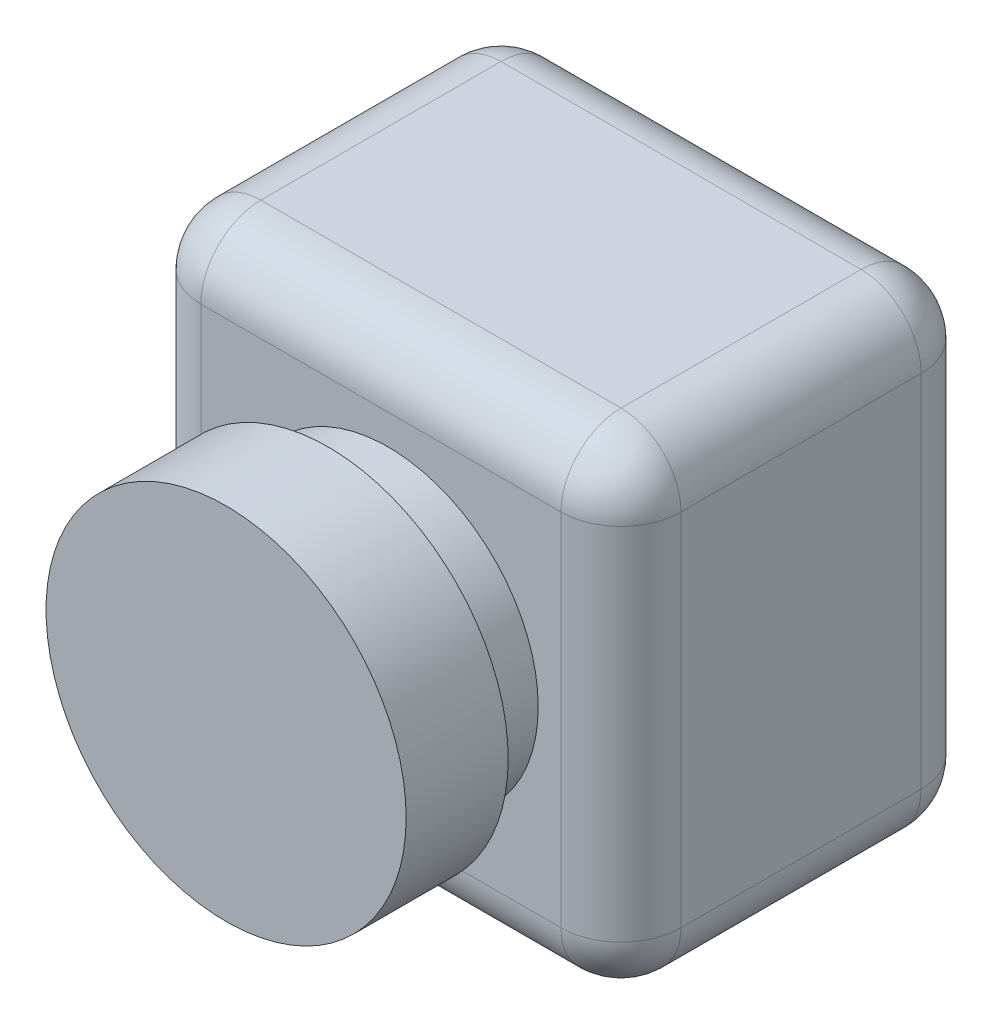
ISO-10303-21;
HEADER;
FILE_DESCRIPTION(('STEP AP214'),'2;1');
FILE_NAME('part.step','',(''),(''),'','','');
FILE_SCHEMA(('AUTOMOTIVE_DESIGN { 1 0 10303 214 1 1 1 1 }'));
ENDSEC;
DATA;
#1=APPLICATION_CONTEXT('core data for automotive mechanical design processes');
#2=APPLICATION_PROTOCOL_DEFINITION('international standard','automotive_design',2000,#1);
#3=PRODUCT_CONTEXT('',#1,'mechanical');
#4=PRODUCT('Part','Part','',(#3));
#5=PRODUCT_RELATED_PRODUCT_CATEGORY('part','',(#4));
#6=PRODUCT_DEFINITION_FORMATION('','',#4);
#7=PRODUCT_DEFINITION_CONTEXT('part definition',#1,'design');
#8=PRODUCT_DEFINITION('design','',#6,#7);
#9=PRODUCT_DEFINITION_SHAPE('','',#8);
#10=(LENGTH_UNIT() NAMED_UNIT(*) SI_UNIT(.MILLI.,.METRE.));
#11=(NAMED_UNIT(*) PLANE_ANGLE_UNIT() SI_UNIT($,.RADIAN.));
#12=(NAMED_UNIT(*) SI_UNIT($,.STERADIAN.) SOLID_ANGLE_UNIT());
#13=UNCERTAINTY_MEASURE_WITH_UNIT(LENGTH_MEASURE(1.E-05),#10,'distance_accuracy_value','');
#14=(GEOMETRIC_REPRESENTATION_CONTEXT(3) GLOBAL_UNCERTAINTY_ASSIGNED_CONTEXT((#13)) GLOBAL_UNIT_ASSIGNED_CONTEXT((#10,
#11,#12)) REPRESENTATION_CONTEXT('',''));
#15=CARTESIAN_POINT('',(0.,0.,0.));
#16=DIRECTION('',(0.,0.,1.));
#17=DIRECTION('',(1.,0.,0.));
#18=AXIS2_PLACEMENT_3D('',#15,#16,#17);
#19=CARTESIAN_POINT('',(0.,0.,60.));
#20=DIRECTION('',(1.,0.,0.));
#21=DIRECTION('',(0.,1.,0.));
#22=AXIS2_PLACEMENT_3D('',#19,#20,#21);
#23=PLANE('',#22);
#24=DIRECTION('',(0.,0.,-1.));
#25=VECTOR('',#24,1.);
#26=CARTESIAN_POINT('',(0.,-70.,60.));
#27=LINE('',#26,#25);
#28=CARTESIAN_POINT('',(0.,-70.,10.));
#29=VERTEX_POINT('',#28);
#30=CARTESIAN_POINT('',(0.,-70.,50.));
#31=VERTEX_POINT('',#30);
#32=EDGE_CURVE('E181',#29,#31,#27,.F.);
#33=ORIENTED_EDGE('',*,*,#32,.T.);
#34=DIRECTION('',(0.,-1.,0.));
#35=VECTOR('',#34,1.);
#36=CARTESIAN_POINT('',(0.,0.,50.));
#37=LINE('',#36,#35);
#38=CARTESIAN_POINT('',(0.,-10.,50.));
#39=VERTEX_POINT('',#38);
#40=EDGE_CURVE('E183',#31,#39,#37,.F.);
#41=ORIENTED_EDGE('',*,*,#40,.T.);
#42=DIRECTION('',(0.,0.,-1.));
#43=VECTOR('',#42,1.);
#44=CARTESIAN_POINT('',(0.,-10.,60.));
#45=LINE('',#44,#43);
#46=CARTESIAN_POINT('',(0.,-10.,10.));
#47=VERTEX_POINT('',#46);
#48=EDGE_CURVE('E177',#39,#47,#45,.T.);
#49=ORIENTED_EDGE('',*,*,#48,.T.);
#50=DIRECTION('',(0.,-1.,0.));
#51=VECTOR('',#50,1.);
#52=CARTESIAN_POINT('',(0.,0.,10.));
#53=LINE('',#52,#51);
#54=EDGE_CURVE('E179',#47,#29,#53,.T.);
#55=ORIENTED_EDGE('',*,*,#54,.T.);
#56=EDGE_LOOP('',(#33,#41,#49,#55));
#57=FACE_BOUND('',#56,.T.);
#58=ADVANCED_FACE('F33',(#57),#23,.F.);
#59=CARTESIAN_POINT('',(0.,-80.,60.));
#60=DIRECTION('',(0.,1.,0.));
#61=DIRECTION('',(0.,0.,1.));
#62=AXIS2_PLACEMENT_3D('',#59,#60,#61);
#63=PLANE('',#62);
#64=DIRECTION('',(1.,0.,0.));
#65=VECTOR('',#64,1.);
#66=CARTESIAN_POINT('',(0.,-80.,50.));
#67=LINE('',#66,#65);
#68=CARTESIAN_POINT('',(70.,-80.,50.));
#69=VERTEX_POINT('',#68);
#70=CARTESIAN_POINT('',(10.,-80.,50.));
#71=VERTEX_POINT('',#70);
#72=EDGE_CURVE('E129',#69,#71,#67,.F.);
#73=ORIENTED_EDGE('',*,*,#72,.T.);
#74=DIRECTION('',(0.,0.,-1.));
#75=VECTOR('',#74,1.);
#76=CARTESIAN_POINT('',(10.,-80.,60.));
#77=LINE('',#76,#75);
#78=CARTESIAN_POINT('',(10.,-80.,10.));
#79=VERTEX_POINT('',#78);
#80=EDGE_CURVE('E166',#71,#79,#77,.T.);
#81=ORIENTED_EDGE('',*,*,#80,.T.);
#82=DIRECTION('',(1.,0.,0.));
#83=VECTOR('',#82,1.);
#84=CARTESIAN_POINT('',(0.,-80.,10.));
#85=LINE('',#84,#83);
#86=CARTESIAN_POINT('',(70.,-80.,10.));
#87=VERTEX_POINT('',#86);
#88=EDGE_CURVE('E159',#79,#87,#85,.T.);
#89=ORIENTED_EDGE('',*,*,#88,.T.);
#90=DIRECTION('',(0.,0.,-1.));
#91=VECTOR('',#90,1.);
#92=CARTESIAN_POINT('',(70.,-80.,60.));
#93=LINE('',#92,#91);
#94=EDGE_CURVE('E157',#87,#69,#93,.F.);
#95=ORIENTED_EDGE('',*,*,#94,.T.);
#96=EDGE_LOOP('',(#73,#81,#89,#95));
#97=FACE_BOUND('',#96,.T.);
#98=ADVANCED_FACE('F327',(#97),#63,.F.);
#99=CARTESIAN_POINT('',(80.,0.,60.));
#100=DIRECTION('',(-1.,0.,0.));
#101=DIRECTION('',(0.,-1.,0.));
#102=AXIS2_PLACEMENT_3D('',#99,#100,#101);
#103=PLANE('',#102);
#104=DIRECTION('',(0.,1.,0.));
#105=VECTOR('',#104,1.);
#106=CARTESIAN_POINT('',(80.,-80.,50.));
#107=LINE('',#106,#105);
#108=CARTESIAN_POINT('',(80.,-10.,50.));
#109=VERTEX_POINT('',#108);
#110=CARTESIAN_POINT('',(80.,-70.,50.));
#111=VERTEX_POINT('',#110);
#112=EDGE_CURVE('E42',#109,#111,#107,.F.);
#113=ORIENTED_EDGE('',*,*,#112,.T.);
#114=DIRECTION('',(0.,0.,-1.));
#115=VECTOR('',#114,1.);
#116=CARTESIAN_POINT('',(80.,-70.,60.));
#117=LINE('',#116,#115);
#118=CARTESIAN_POINT('',(80.,-70.,10.));
#119=VERTEX_POINT('',#118);
#120=EDGE_CURVE('E11',#111,#119,#117,.T.);
#121=ORIENTED_EDGE('',*,*,#120,.T.);
#122=DIRECTION('',(0.,1.,0.));
#123=VECTOR('',#122,1.);
#124=CARTESIAN_POINT('',(80.,0.,10.));
#125=LINE('',#124,#123);
#126=CARTESIAN_POINT('',(80.,-10.,10.));
#127=VERTEX_POINT('',#126);
#128=EDGE_CURVE('E195',#119,#127,#125,.T.);
#129=ORIENTED_EDGE('',*,*,#128,.T.);
#130=DIRECTION('',(0.,0.,-1.));
#131=VECTOR('',#130,1.);
#132=CARTESIAN_POINT('',(80.,-10.,60.));
#133=LINE('',#132,#131);
#134=EDGE_CURVE('E53',#127,#109,#133,.F.);
#135=ORIENTED_EDGE('',*,*,#134,.T.);
#136=EDGE_LOOP('',(#113,#121,#129,#135));
#137=FACE_BOUND('',#136,.T.);
#138=ADVANCED_FACE('F332',(#137),#103,.F.);
#139=CARTESIAN_POINT('',(0.,0.,60.));
#140=DIRECTION('',(0.,-1.,0.));
#141=DIRECTION('',(0.,0.,-1.));
#142=AXIS2_PLACEMENT_3D('',#139,#140,#141);
#143=PLANE('',#142);
#144=DIRECTION('',(0.,0.,-1.));
#145=VECTOR('',#144,1.);
#146=CARTESIAN_POINT('',(10.,0.,60.));
#147=LINE('',#146,#145);
#148=CARTESIAN_POINT('',(10.,0.,10.));
#149=VERTEX_POINT('',#148);
#150=CARTESIAN_POINT('',(10.,0.,50.));
#151=VERTEX_POINT('',#150);
#152=EDGE_CURVE('E190',#149,#151,#147,.F.);
#153=ORIENTED_EDGE('',*,*,#152,.T.);
#154=DIRECTION('',(-1.,0.,0.));
#155=VECTOR('',#154,1.);
#156=CARTESIAN_POINT('',(80.,0.,50.));
#157=LINE('',#156,#155);
#158=CARTESIAN_POINT('',(70.,0.,50.));
#159=VERTEX_POINT('',#158);
#160=EDGE_CURVE('E192',#151,#159,#157,.F.);
#161=ORIENTED_EDGE('',*,*,#160,.T.);
#162=DIRECTION('',(0.,0.,-1.));
#163=VECTOR('',#162,1.);
#164=CARTESIAN_POINT('',(70.,0.,60.));
#165=LINE('',#164,#163);
#166=CARTESIAN_POINT('',(70.,0.,10.));
#167=VERTEX_POINT('',#166);
#168=EDGE_CURVE('E186',#159,#167,#165,.T.);
#169=ORIENTED_EDGE('',*,*,#168,.T.);
#170=DIRECTION('',(-1.,0.,0.));
#171=VECTOR('',#170,1.);
#172=CARTESIAN_POINT('',(0.,0.,10.));
#173=LINE('',#172,#171);
#174=EDGE_CURVE('E188',#167,#149,#173,.T.);
#175=ORIENTED_EDGE('',*,*,#174,.T.);
#176=EDGE_LOOP('',(#153,#161,#169,#175));
#177=FACE_BOUND('',#176,.T.);
#178=ADVANCED_FACE('F278',(#177),#143,.F.);
#179=CARTESIAN_POINT('',(0.,0.,60.));
#180=DIRECTION('',(0.,0.,1.));
#181=DIRECTION('',(1.,0.,0.));
#182=AXIS2_PLACEMENT_3D('',#179,#180,#181);
#183=PLANE('',#182);
#184=CARTESIAN_POINT('',(41.2074397884217,-40.,60.));
#185=DIRECTION('',(0.,0.,1.));
#186=DIRECTION('',(1.,0.,0.));
#187=AXIS2_PLACEMENT_3D('',#184,#185,#186);
#188=CIRCLE('',#187,25.);
#189=CARTESIAN_POINT('',(66.2074397884217,-40.,60.));
#190=VERTEX_POINT('',#189);
#191=EDGE_CURVE('E389',#190,#190,#188,.T.);
#192=ORIENTED_EDGE('',*,*,#191,.F.);
#193=EDGE_LOOP('',(#192));
#194=FACE_BOUND('',#193,.T.);
#195=DIRECTION('',(0.,-1.,0.));
#196=VECTOR('',#195,1.);
#197=CARTESIAN_POINT('',(10.,-80.,60.));
#198=LINE('',#197,#196);
#199=CARTESIAN_POINT('',(10.,-10.,60.));
#200=VERTEX_POINT('',#199);
#201=CARTESIAN_POINT('',(10.,-70.,60.));
#202=VERTEX_POINT('',#201);
#203=EDGE_CURVE('E155',#200,#202,#198,.T.);
#204=ORIENTED_EDGE('',*,*,#203,.T.);
#205=DIRECTION('',(1.,0.,0.));
#206=VECTOR('',#205,1.);
#207=CARTESIAN_POINT('',(80.,-70.,60.));
#208=LINE('',#207,#206);
#209=CARTESIAN_POINT('',(70.,-70.,60.));
#210=VERTEX_POINT('',#209);
#211=EDGE_CURVE('E127',#202,#210,#208,.T.);
#212=ORIENTED_EDGE('',*,*,#211,.T.);
#213=DIRECTION('',(0.,1.,0.));
#214=VECTOR('',#213,1.);
#215=CARTESIAN_POINT('',(70.,0.,60.));
#216=LINE('',#215,#214);
#217=CARTESIAN_POINT('',(70.,-10.,60.));
#218=VERTEX_POINT('',#217);
#219=EDGE_CURVE('E145',#210,#218,#216,.T.);
#220=ORIENTED_EDGE('',*,*,#219,.T.);
#221=DIRECTION('',(-1.,0.,0.));
#222=VECTOR('',#221,1.);
#223=CARTESIAN_POINT('',(0.,-10.,60.));
#224=LINE('',#223,#222);
#225=EDGE_CURVE('E151',#218,#200,#224,.T.);
#226=ORIENTED_EDGE('',*,*,#225,.T.);
#227=EDGE_LOOP('',(#204,#212,#220,#226));
#228=FACE_BOUND('',#227,.T.);
#229=ADVANCED_FACE('F153',(#194,#228),#183,.T.);
#230=CARTESIAN_POINT('',(0.,0.,0.));
#231=DIRECTION('',(0.,0.,1.));
#232=DIRECTION('',(1.,0.,0.));
#233=AXIS2_PLACEMENT_3D('',#230,#231,#232);
#234=PLANE('',#233);
#235=DIRECTION('',(0.,1.,0.));
#236=VECTOR('',#235,1.);
#237=CARTESIAN_POINT('',(70.,0.,0.));
#238=LINE('',#237,#236);
#239=CARTESIAN_POINT('',(70.,-10.,0.));
#240=VERTEX_POINT('',#239);
#241=CARTESIAN_POINT('',(70.,-70.,0.));
#242=VERTEX_POINT('',#241);
#243=EDGE_CURVE('E168',#240,#242,#238,.F.);
#244=ORIENTED_EDGE('',*,*,#243,.T.);
#245=DIRECTION('',(1.,0.,0.));
#246=VECTOR('',#245,1.);
#247=CARTESIAN_POINT('',(0.,-70.,0.));
#248=LINE('',#247,#246);
#249=CARTESIAN_POINT('',(10.,-70.,0.));
#250=VERTEX_POINT('',#249);
#251=EDGE_CURVE('E174',#242,#250,#248,.F.);
#252=ORIENTED_EDGE('',*,*,#251,.T.);
#253=DIRECTION('',(0.,-1.,0.));
#254=VECTOR('',#253,1.);
#255=CARTESIAN_POINT('',(10.,0.,0.));
#256=LINE('',#255,#254);
#257=CARTESIAN_POINT('',(10.,-10.,0.));
#258=VERTEX_POINT('',#257);
#259=EDGE_CURVE('E172',#250,#258,#256,.F.);
#260=ORIENTED_EDGE('',*,*,#259,.T.);
#261=DIRECTION('',(-1.,0.,0.));
#262=VECTOR('',#261,1.);
#263=CARTESIAN_POINT('',(0.,-10.,0.));
#264=LINE('',#263,#262);
#265=EDGE_CURVE('E170',#258,#240,#264,.F.);
#266=ORIENTED_EDGE('',*,*,#265,.T.);
#267=EDGE_LOOP('',(#244,#252,#260,#266));
#268=FACE_BOUND('',#267,.T.);
#269=ADVANCED_FACE('F296',(#268),#234,.F.);
#270=CARTESIAN_POINT('',(0.,-10.,10.));
#271=DIRECTION('',(-1.,0.,0.));
#272=DIRECTION('',(0.,0.,1.));
#273=AXIS2_PLACEMENT_3D('',#270,#271,#272);
#274=CYLINDRICAL_SURFACE('',#273,10.);
#275=CARTESIAN_POINT('',(10.,-10.,10.));
#276=DIRECTION('',(-1.,0.,0.));
#277=DIRECTION('',(0.,0.,1.));
#278=AXIS2_PLACEMENT_3D('',#275,#276,#277);
#279=CIRCLE('',#278,10.);
#280=EDGE_CURVE('E37',#149,#258,#279,.T.);
#281=ORIENTED_EDGE('',*,*,#280,.F.);
#282=ORIENTED_EDGE('',*,*,#174,.F.);
#283=CARTESIAN_POINT('',(70.,-10.,10.));
#284=DIRECTION('',(1.,0.,0.));
#285=DIRECTION('',(0.,0.,-1.));
#286=AXIS2_PLACEMENT_3D('',#283,#284,#285);
#287=CIRCLE('',#286,10.);
#288=EDGE_CURVE('E247',#240,#167,#287,.T.);
#289=ORIENTED_EDGE('',*,*,#288,.F.);
#290=ORIENTED_EDGE('',*,*,#265,.F.);
#291=EDGE_LOOP('',(#281,#282,#289,#290));
#292=FACE_BOUND('',#291,.T.);
#293=ADVANCED_FACE('F35',(#292),#274,.T.);
#294=CARTESIAN_POINT('',(10.,-10.,10.));
#295=DIRECTION('',(0.,0.,1.));
#296=DIRECTION('',(1.,0.,0.));
#297=AXIS2_PLACEMENT_3D('',#294,#295,#296);
#298=SPHERICAL_SURFACE('',#297,10.);
#299=CARTESIAN_POINT('',(10.,-10.,10.));
#300=DIRECTION('',(0.,0.,-1.));
#301=DIRECTION('',(-1.,0.,0.));
#302=AXIS2_PLACEMENT_3D('',#299,#300,#301);
#303=CIRCLE('',#302,10.);
#304=EDGE_CURVE('E242',#149,#47,#303,.F.);
#305=ORIENTED_EDGE('',*,*,#304,.F.);
#306=ORIENTED_EDGE('',*,*,#280,.T.);
#307=CARTESIAN_POINT('',(10.,-10.,10.));
#308=DIRECTION('',(0.,1.,0.));
#309=DIRECTION('',(-1.,0.,0.));
#310=AXIS2_PLACEMENT_3D('',#307,#308,#309);
#311=CIRCLE('',#310,10.);
#312=EDGE_CURVE('E245',#47,#258,#311,.F.);
#313=ORIENTED_EDGE('',*,*,#312,.F.);
#314=EDGE_LOOP('',(#305,#306,#313));
#315=FACE_BOUND('',#314,.T.);
#316=ADVANCED_FACE('F258',(#315),#298,.T.);
#317=CARTESIAN_POINT('',(70.,-10.,10.));
#318=DIRECTION('',(0.,0.,1.));
#319=DIRECTION('',(1.,0.,0.));
#320=AXIS2_PLACEMENT_3D('',#317,#318,#319);
#321=SPHERICAL_SURFACE('',#320,10.);
#322=CARTESIAN_POINT('',(70.,-10.,10.));
#323=DIRECTION('',(0.,1.,0.));
#324=DIRECTION('',(-1.,0.,0.));
#325=AXIS2_PLACEMENT_3D('',#322,#323,#324);
#326=CIRCLE('',#325,10.);
#327=EDGE_CURVE('E236',#240,#127,#326,.F.);
#328=ORIENTED_EDGE('',*,*,#327,.F.);
#329=ORIENTED_EDGE('',*,*,#288,.T.);
#330=CARTESIAN_POINT('',(70.,-10.,10.));
#331=DIRECTION('',(0.,0.,-1.));
#332=DIRECTION('',(-1.,0.,0.));
#333=AXIS2_PLACEMENT_3D('',#330,#331,#332);
#334=CIRCLE('',#333,10.);
#335=EDGE_CURVE('E239',#127,#167,#334,.F.);
#336=ORIENTED_EDGE('',*,*,#335,.F.);
#337=EDGE_LOOP('',(#328,#329,#336));
#338=FACE_BOUND('',#337,.T.);
#339=ADVANCED_FACE('F289',(#338),#321,.T.);
#340=CARTESIAN_POINT('',(10.,0.,10.));
#341=DIRECTION('',(0.,-1.,0.));
#342=DIRECTION('',(1.,0.,0.));
#343=AXIS2_PLACEMENT_3D('',#340,#341,#342);
#344=CYLINDRICAL_SURFACE('',#343,10.);
#345=ORIENTED_EDGE('',*,*,#312,.T.);
#346=ORIENTED_EDGE('',*,*,#259,.F.);
#347=CARTESIAN_POINT('',(10.,-70.,10.));
#348=DIRECTION('',(0.,-1.,0.));
#349=DIRECTION('',(0.,0.,-1.));
#350=AXIS2_PLACEMENT_3D('',#347,#348,#349);
#351=CIRCLE('',#350,10.);
#352=EDGE_CURVE('E231',#29,#250,#351,.T.);
#353=ORIENTED_EDGE('',*,*,#352,.F.);
#354=ORIENTED_EDGE('',*,*,#54,.F.);
#355=EDGE_LOOP('',(#345,#346,#353,#354));
#356=FACE_BOUND('',#355,.T.);
#357=ADVANCED_FACE('F266',(#356),#344,.T.);
#358=CARTESIAN_POINT('',(10.,-10.,60.));
#359=DIRECTION('',(0.,0.,-1.));
#360=DIRECTION('',(-1.,0.,0.));
#361=AXIS2_PLACEMENT_3D('',#358,#359,#360);
#362=CYLINDRICAL_SURFACE('',#361,10.);
#363=ORIENTED_EDGE('',*,*,#304,.T.);
#364=ORIENTED_EDGE('',*,*,#48,.F.);
#365=CARTESIAN_POINT('',(10.,-10.,50.));
#366=DIRECTION('',(0.,0.,1.));
#367=DIRECTION('',(1.,0.,0.));
#368=AXIS2_PLACEMENT_3D('',#365,#366,#367);
#369=CIRCLE('',#368,10.);
#370=EDGE_CURVE('E228',#151,#39,#369,.T.);
#371=ORIENTED_EDGE('',*,*,#370,.F.);
#372=ORIENTED_EDGE('',*,*,#152,.F.);
#373=EDGE_LOOP('',(#363,#364,#371,#372));
#374=FACE_BOUND('',#373,.T.);
#375=ADVANCED_FACE('F275',(#374),#362,.T.);
#376=CARTESIAN_POINT('',(0.,-10.,50.));
#377=DIRECTION('',(1.,0.,0.));
#378=DIRECTION('',(0.,0.,-1.));
#379=AXIS2_PLACEMENT_3D('',#376,#377,#378);
#380=CYLINDRICAL_SURFACE('',#379,10.);
#381=CARTESIAN_POINT('',(70.,-10.,50.));
#382=DIRECTION('',(1.,0.,0.));
#383=DIRECTION('',(0.,0.,-1.));
#384=AXIS2_PLACEMENT_3D('',#381,#382,#383);
#385=CIRCLE('',#384,10.);
#386=EDGE_CURVE('E222',#159,#218,#385,.T.);
#387=ORIENTED_EDGE('',*,*,#386,.F.);
#388=ORIENTED_EDGE('',*,*,#160,.F.);
#389=CARTESIAN_POINT('',(10.,-10.,50.));
#390=DIRECTION('',(-1.,0.,0.));
#391=DIRECTION('',(0.,0.,1.));
#392=AXIS2_PLACEMENT_3D('',#389,#390,#391);
#393=CIRCLE('',#392,10.);
#394=EDGE_CURVE('E225',#200,#151,#393,.T.);
#395=ORIENTED_EDGE('',*,*,#394,.F.);
#396=ORIENTED_EDGE('',*,*,#225,.F.);
#397=EDGE_LOOP('',(#387,#388,#395,#396));
#398=FACE_BOUND('',#397,.T.);
#399=ADVANCED_FACE('F282',(#398),#380,.T.);
#400=CARTESIAN_POINT('',(70.,-10.,60.));
#401=DIRECTION('',(0.,0.,-1.));
#402=DIRECTION('',(-1.,0.,0.));
#403=AXIS2_PLACEMENT_3D('',#400,#401,#402);
#404=CYLINDRICAL_SURFACE('',#403,10.);
#405=ORIENTED_EDGE('',*,*,#335,.T.);
#406=ORIENTED_EDGE('',*,*,#168,.F.);
#407=CARTESIAN_POINT('',(70.,-10.,50.));
#408=DIRECTION('',(0.,0.,1.));
#409=DIRECTION('',(1.,0.,0.));
#410=AXIS2_PLACEMENT_3D('',#407,#408,#409);
#411=CIRCLE('',#410,10.);
#412=EDGE_CURVE('E220',#109,#159,#411,.T.);
#413=ORIENTED_EDGE('',*,*,#412,.F.);
#414=ORIENTED_EDGE('',*,*,#134,.F.);
#415=EDGE_LOOP('',(#405,#406,#413,#414));
#416=FACE_BOUND('',#415,.T.);
#417=ADVANCED_FACE('F287',(#416),#404,.T.);
#418=CARTESIAN_POINT('',(70.,0.,10.));
#419=DIRECTION('',(0.,1.,0.));
#420=DIRECTION('',(-1.,0.,0.));
#421=AXIS2_PLACEMENT_3D('',#418,#419,#420);
#422=CYLINDRICAL_SURFACE('',#421,10.);
#423=ORIENTED_EDGE('',*,*,#327,.T.);
#424=ORIENTED_EDGE('',*,*,#128,.F.);
#425=CARTESIAN_POINT('',(70.,-70.,10.));
#426=DIRECTION('',(0.,-1.,0.));
#427=DIRECTION('',(0.,0.,-1.));
#428=AXIS2_PLACEMENT_3D('',#425,#426,#427);
#429=CIRCLE('',#428,10.);
#430=EDGE_CURVE('E217',#242,#119,#429,.T.);
#431=ORIENTED_EDGE('',*,*,#430,.F.);
#432=ORIENTED_EDGE('',*,*,#243,.F.);
#433=EDGE_LOOP('',(#423,#424,#431,#432));
#434=FACE_BOUND('',#433,.T.);
#435=ADVANCED_FACE('F293',(#434),#422,.T.);
#436=CARTESIAN_POINT('',(0.,-70.,10.));
#437=DIRECTION('',(1.,0.,0.));
#438=DIRECTION('',(0.,0.,-1.));
#439=AXIS2_PLACEMENT_3D('',#436,#437,#438);
#440=CYLINDRICAL_SURFACE('',#439,10.);
#441=CARTESIAN_POINT('',(10.,-70.,10.));
#442=DIRECTION('',(-1.,0.,0.));
#443=DIRECTION('',(0.,0.,1.));
#444=AXIS2_PLACEMENT_3D('',#441,#442,#443);
#445=CIRCLE('',#444,10.);
#446=EDGE_CURVE('E233',#250,#79,#445,.T.);
#447=ORIENTED_EDGE('',*,*,#446,.F.);
#448=ORIENTED_EDGE('',*,*,#251,.F.);
#449=CARTESIAN_POINT('',(70.,-70.,10.));
#450=DIRECTION('',(1.,0.,0.));
#451=DIRECTION('',(0.,0.,-1.));
#452=AXIS2_PLACEMENT_3D('',#449,#450,#451);
#453=CIRCLE('',#452,10.);
#454=EDGE_CURVE('E214',#87,#242,#453,.T.);
#455=ORIENTED_EDGE('',*,*,#454,.F.);
#456=ORIENTED_EDGE('',*,*,#88,.F.);
#457=EDGE_LOOP('',(#447,#448,#455,#456));
#458=FACE_BOUND('',#457,.T.);
#459=ADVANCED_FACE('F300',(#458),#440,.T.);
#460=CARTESIAN_POINT('',(10.,-70.,10.));
#461=DIRECTION('',(0.,0.,1.));
#462=DIRECTION('',(1.,0.,0.));
#463=AXIS2_PLACEMENT_3D('',#460,#461,#462);
#464=SPHERICAL_SURFACE('',#463,10.);
#465=ORIENTED_EDGE('',*,*,#352,.T.);
#466=ORIENTED_EDGE('',*,*,#446,.T.);
#467=CARTESIAN_POINT('',(10.,-70.,10.));
#468=DIRECTION('',(0.,0.,-1.));
#469=DIRECTION('',(-1.,0.,0.));
#470=AXIS2_PLACEMENT_3D('',#467,#468,#469);
#471=CIRCLE('',#470,10.);
#472=EDGE_CURVE('E211',#29,#79,#471,.F.);
#473=ORIENTED_EDGE('',*,*,#472,.F.);
#474=EDGE_LOOP('',(#465,#466,#473));
#475=FACE_BOUND('',#474,.T.);
#476=ADVANCED_FACE('F304',(#475),#464,.T.);
#477=CARTESIAN_POINT('',(10.,-10.,50.));
#478=DIRECTION('',(0.,0.,1.));
#479=DIRECTION('',(1.,0.,0.));
#480=AXIS2_PLACEMENT_3D('',#477,#478,#479);
#481=SPHERICAL_SURFACE('',#480,10.);
#482=ORIENTED_EDGE('',*,*,#394,.T.);
#483=ORIENTED_EDGE('',*,*,#370,.T.);
#484=CARTESIAN_POINT('',(10.,-10.,50.));
#485=DIRECTION('',(0.,1.,0.));
#486=DIRECTION('',(-1.,0.,0.));
#487=AXIS2_PLACEMENT_3D('',#484,#485,#486);
#488=CIRCLE('',#487,10.);
#489=EDGE_CURVE('E209',#200,#39,#488,.F.);
#490=ORIENTED_EDGE('',*,*,#489,.F.);
#491=EDGE_LOOP('',(#482,#483,#490));
#492=FACE_BOUND('',#491,.T.);
#493=ADVANCED_FACE('F315',(#492),#481,.T.);
#494=CARTESIAN_POINT('',(70.,-10.,50.));
#495=DIRECTION('',(0.,0.,1.));
#496=DIRECTION('',(1.,0.,0.));
#497=AXIS2_PLACEMENT_3D('',#494,#495,#496);
#498=SPHERICAL_SURFACE('',#497,10.);
#499=ORIENTED_EDGE('',*,*,#412,.T.);
#500=ORIENTED_EDGE('',*,*,#386,.T.);
#501=CARTESIAN_POINT('',(70.,-10.,50.));
#502=DIRECTION('',(0.,1.,0.));
#503=DIRECTION('',(-1.,0.,0.));
#504=AXIS2_PLACEMENT_3D('',#501,#502,#503);
#505=CIRCLE('',#504,10.);
#506=EDGE_CURVE('E148',#109,#218,#505,.F.);
#507=ORIENTED_EDGE('',*,*,#506,.F.);
#508=EDGE_LOOP('',(#499,#500,#507));
#509=FACE_BOUND('',#508,.T.);
#510=ADVANCED_FACE('F317',(#509),#498,.T.);
#511=CARTESIAN_POINT('',(70.,-70.,10.));
#512=DIRECTION('',(0.,0.,1.));
#513=DIRECTION('',(1.,0.,0.));
#514=AXIS2_PLACEMENT_3D('',#511,#512,#513);
#515=SPHERICAL_SURFACE('',#514,10.);
#516=ORIENTED_EDGE('',*,*,#454,.T.);
#517=ORIENTED_EDGE('',*,*,#430,.T.);
#518=CARTESIAN_POINT('',(70.,-70.,10.));
#519=DIRECTION('',(0.,0.,-1.));
#520=DIRECTION('',(-1.,0.,0.));
#521=AXIS2_PLACEMENT_3D('',#518,#519,#520);
#522=CIRCLE('',#521,10.);
#523=EDGE_CURVE('E206',#87,#119,#522,.F.);
#524=ORIENTED_EDGE('',*,*,#523,.F.);
#525=EDGE_LOOP('',(#516,#517,#524));
#526=FACE_BOUND('',#525,.T.);
#527=ADVANCED_FACE('F323',(#526),#515,.T.);
#528=CARTESIAN_POINT('',(10.,-70.,60.));
#529=DIRECTION('',(0.,0.,-1.));
#530=DIRECTION('',(-1.,0.,0.));
#531=AXIS2_PLACEMENT_3D('',#528,#529,#530);
#532=CYLINDRICAL_SURFACE('',#531,10.);
#533=ORIENTED_EDGE('',*,*,#472,.T.);
#534=ORIENTED_EDGE('',*,*,#80,.F.);
#535=CARTESIAN_POINT('',(10.,-70.,50.));
#536=DIRECTION('',(0.,0.,1.));
#537=DIRECTION('',(1.,0.,0.));
#538=AXIS2_PLACEMENT_3D('',#535,#536,#537);
#539=CIRCLE('',#538,10.);
#540=EDGE_CURVE('E203',#31,#71,#539,.T.);
#541=ORIENTED_EDGE('',*,*,#540,.F.);
#542=ORIENTED_EDGE('',*,*,#32,.F.);
#543=EDGE_LOOP('',(#533,#534,#541,#542));
#544=FACE_BOUND('',#543,.T.);
#545=ADVANCED_FACE('F307',(#544),#532,.T.);
#546=CARTESIAN_POINT('',(10.,0.,50.));
#547=DIRECTION('',(0.,1.,0.));
#548=DIRECTION('',(-1.,0.,0.));
#549=AXIS2_PLACEMENT_3D('',#546,#547,#548);
#550=CYLINDRICAL_SURFACE('',#549,10.);
#551=ORIENTED_EDGE('',*,*,#489,.T.);
#552=ORIENTED_EDGE('',*,*,#40,.F.);
#553=CARTESIAN_POINT('',(10.,-70.,50.));
#554=DIRECTION('',(0.,-1.,0.));
#555=DIRECTION('',(0.,0.,-1.));
#556=AXIS2_PLACEMENT_3D('',#553,#554,#555);
#557=CIRCLE('',#556,10.);
#558=EDGE_CURVE('E142',#202,#31,#557,.T.);
#559=ORIENTED_EDGE('',*,*,#558,.F.);
#560=ORIENTED_EDGE('',*,*,#203,.F.);
#561=EDGE_LOOP('',(#551,#552,#559,#560));
#562=FACE_BOUND('',#561,.T.);
#563=ADVANCED_FACE('F313',(#562),#550,.T.);
#564=CARTESIAN_POINT('',(70.,0.,50.));
#565=DIRECTION('',(0.,-1.,0.));
#566=DIRECTION('',(1.,0.,0.));
#567=AXIS2_PLACEMENT_3D('',#564,#565,#566);
#568=CYLINDRICAL_SURFACE('',#567,10.);
#569=ORIENTED_EDGE('',*,*,#506,.T.);
#570=ORIENTED_EDGE('',*,*,#219,.F.);
#571=CARTESIAN_POINT('',(70.,-70.,50.));
#572=DIRECTION('',(0.,-1.,0.));
#573=DIRECTION('',(0.,0.,-1.));
#574=AXIS2_PLACEMENT_3D('',#571,#572,#573);
#575=CIRCLE('',#574,10.);
#576=EDGE_CURVE('E136',#111,#210,#575,.T.);
#577=ORIENTED_EDGE('',*,*,#576,.F.);
#578=ORIENTED_EDGE('',*,*,#112,.F.);
#579=EDGE_LOOP('',(#569,#570,#577,#578));
#580=FACE_BOUND('',#579,.T.);
#581=ADVANCED_FACE('F146',(#580),#568,.T.);
#582=CARTESIAN_POINT('',(70.,-70.,60.));
#583=DIRECTION('',(0.,0.,-1.));
#584=DIRECTION('',(-1.,0.,0.));
#585=AXIS2_PLACEMENT_3D('',#582,#583,#584);
#586=CYLINDRICAL_SURFACE('',#585,10.);
#587=ORIENTED_EDGE('',*,*,#523,.T.);
#588=ORIENTED_EDGE('',*,*,#120,.F.);
#589=CARTESIAN_POINT('',(70.,-70.,50.));
#590=DIRECTION('',(0.,0.,1.));
#591=DIRECTION('',(1.,0.,0.));
#592=AXIS2_PLACEMENT_3D('',#589,#590,#591);
#593=CIRCLE('',#592,10.);
#594=EDGE_CURVE('E140',#69,#111,#593,.T.);
#595=ORIENTED_EDGE('',*,*,#594,.F.);
#596=ORIENTED_EDGE('',*,*,#94,.F.);
#597=EDGE_LOOP('',(#587,#588,#595,#596));
#598=FACE_BOUND('',#597,.T.);
#599=ADVANCED_FACE('F344',(#598),#586,.T.);
#600=CARTESIAN_POINT('',(10.,-70.,50.));
#601=DIRECTION('',(0.,0.,1.));
#602=DIRECTION('',(1.,0.,0.));
#603=AXIS2_PLACEMENT_3D('',#600,#601,#602);
#604=SPHERICAL_SURFACE('',#603,10.);
#605=ORIENTED_EDGE('',*,*,#558,.T.);
#606=ORIENTED_EDGE('',*,*,#540,.T.);
#607=CARTESIAN_POINT('',(10.,-70.,50.));
#608=DIRECTION('',(-1.,0.,0.));
#609=DIRECTION('',(0.,0.,1.));
#610=AXIS2_PLACEMENT_3D('',#607,#608,#609);
#611=CIRCLE('',#610,10.);
#612=EDGE_CURVE('E132',#202,#71,#611,.F.);
#613=ORIENTED_EDGE('',*,*,#612,.F.);
#614=EDGE_LOOP('',(#605,#606,#613));
#615=FACE_BOUND('',#614,.T.);
#616=ADVANCED_FACE('F311',(#615),#604,.T.);
#617=CARTESIAN_POINT('',(70.,-70.,50.));
#618=DIRECTION('',(0.,0.,1.));
#619=DIRECTION('',(1.,0.,0.));
#620=AXIS2_PLACEMENT_3D('',#617,#618,#619);
#621=SPHERICAL_SURFACE('',#620,10.);
#622=ORIENTED_EDGE('',*,*,#594,.T.);
#623=ORIENTED_EDGE('',*,*,#576,.T.);
#624=CARTESIAN_POINT('',(70.,-70.,50.));
#625=DIRECTION('',(1.,0.,0.));
#626=DIRECTION('',(0.,0.,-1.));
#627=AXIS2_PLACEMENT_3D('',#624,#625,#626);
#628=CIRCLE('',#627,10.);
#629=EDGE_CURVE('E123',#69,#210,#628,.F.);
#630=ORIENTED_EDGE('',*,*,#629,.F.);
#631=EDGE_LOOP('',(#622,#623,#630));
#632=FACE_BOUND('',#631,.T.);
#633=ADVANCED_FACE('F138',(#632),#621,.T.);
#634=CARTESIAN_POINT('',(0.,-70.,50.));
#635=DIRECTION('',(-1.,0.,0.));
#636=DIRECTION('',(0.,0.,1.));
#637=AXIS2_PLACEMENT_3D('',#634,#635,#636);
#638=CYLINDRICAL_SURFACE('',#637,10.);
#639=ORIENTED_EDGE('',*,*,#612,.T.);
#640=ORIENTED_EDGE('',*,*,#72,.F.);
#641=ORIENTED_EDGE('',*,*,#629,.T.);
#642=ORIENTED_EDGE('',*,*,#211,.F.);
#643=EDGE_LOOP('',(#639,#640,#641,#642));
#644=FACE_BOUND('',#643,.T.);
#645=ADVANCED_FACE('F125',(#644),#638,.T.);
#646=CARTESIAN_POINT('',(41.2074397884217,-40.,70.));
#647=DIRECTION('',(0.,0.,-1.));
#648=DIRECTION('',(-1.,0.,0.));
#649=AXIS2_PLACEMENT_3D('',#646,#647,#648);
#650=CYLINDRICAL_SURFACE('',#649,25.);
#651=CARTESIAN_POINT('',(41.2074397884217,-40.,70.));
#652=DIRECTION('',(0.,0.,1.));
#653=DIRECTION('',(1.,0.,0.));
#654=AXIS2_PLACEMENT_3D('',#651,#652,#653);
#655=CIRCLE('',#654,25.);
#656=CARTESIAN_POINT('',(66.2074397884217,-40.,70.));
#657=VERTEX_POINT('',#656);
#658=EDGE_CURVE('E133',#657,#657,#655,.T.);
#659=ORIENTED_EDGE('',*,*,#658,.F.);
#660=EDGE_LOOP('',(#659));
#661=FACE_BOUND('',#660,.T.);
#662=ORIENTED_EDGE('',*,*,#191,.T.);
#663=EDGE_LOOP('',(#662));
#664=FACE_BOUND('',#663,.T.);
#665=ADVANCED_FACE('F339',(#661,#664),#650,.T.);
#666=CARTESIAN_POINT('',(41.2074397884217,-40.,87.));
#667=DIRECTION('',(0.,0.,-1.));
#668=DIRECTION('',(-1.,0.,0.));
#669=AXIS2_PLACEMENT_3D('',#666,#667,#668);
#670=CYLINDRICAL_SURFACE('',#669,30.);
#671=CARTESIAN_POINT('',(41.2074397884217,-40.,87.));
#672=DIRECTION('',(0.,0.,1.));
#673=DIRECTION('',(1.,0.,0.));
#674=AXIS2_PLACEMENT_3D('',#671,#672,#673);
#675=CIRCLE('',#674,30.);
#676=CARTESIAN_POINT('',(71.2074397884217,-40.,87.));
#677=VERTEX_POINT('',#676);
#678=EDGE_CURVE('E388',#677,#677,#675,.T.);
#679=ORIENTED_EDGE('',*,*,#678,.F.);
#680=EDGE_LOOP('',(#679));
#681=FACE_BOUND('',#680,.T.);
#682=CARTESIAN_POINT('',(41.2074397884217,-40.,70.));
#683=DIRECTION('',(0.,0.,1.));
#684=DIRECTION('',(1.,0.,0.));
#685=AXIS2_PLACEMENT_3D('',#682,#683,#684);
#686=CIRCLE('',#685,30.);
#687=CARTESIAN_POINT('',(71.2074397884217,-40.,70.));
#688=VERTEX_POINT('',#687);
#689=EDGE_CURVE('E390',#688,#688,#686,.T.);
#690=ORIENTED_EDGE('',*,*,#689,.T.);
#691=EDGE_LOOP('',(#690));
#692=FACE_BOUND('',#691,.T.);
#693=ADVANCED_FACE('F372',(#681,#692),#670,.T.);
#694=CARTESIAN_POINT('',(41.2074397884217,-40.,87.));
#695=DIRECTION('',(0.,0.,1.));
#696=DIRECTION('',(1.,0.,0.));
#697=AXIS2_PLACEMENT_3D('',#694,#695,#696);
#698=PLANE('',#697);
#699=ORIENTED_EDGE('',*,*,#678,.T.);
#700=EDGE_LOOP('',(#699));
#701=FACE_BOUND('',#700,.T.);
#702=ADVANCED_FACE('F376',(#701),#698,.T.);
#703=CARTESIAN_POINT('',(41.2074397884217,-40.,70.));
#704=DIRECTION('',(0.,0.,1.));
#705=DIRECTION('',(1.,0.,0.));
#706=AXIS2_PLACEMENT_3D('',#703,#704,#705);
#707=PLANE('',#706);
#708=ORIENTED_EDGE('',*,*,#658,.T.);
#709=EDGE_LOOP('',(#708));
#710=FACE_BOUND('',#709,.T.);
#711=ORIENTED_EDGE('',*,*,#689,.F.);
#712=EDGE_LOOP('',(#711));
#713=FACE_BOUND('',#712,.T.);
#714=ADVANCED_FACE('F378',(#710,#713),#707,.F.);
#715=CLOSED_SHELL('',(#58,#98,#138,#178,#229,#269,#293,#316,#339,#357,#375,#399,#417,#435,#459,
#476,#493,#510,#527,#545,#563,#581,#599,#616,#633,#645,#665,#693,#702,#714));
#716=MANIFOLD_SOLID_BREP('B2',#715);
#717=ADVANCED_BREP_SHAPE_REPRESENTATION('',(#18,#716),#14);
#718=SHAPE_DEFINITION_REPRESENTATION(#9,#717);
ENDSEC;
END-ISO-10303-21;
